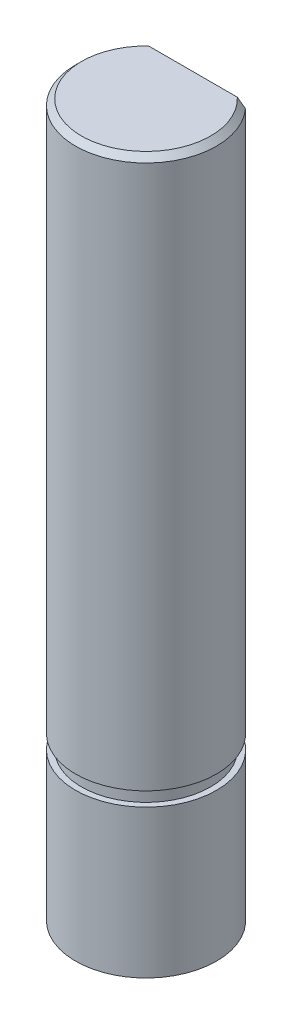
ISO-10303-21;
HEADER;
FILE_DESCRIPTION(('STEP AP214'),'2;1');
FILE_NAME('part.step','',(''),(''),'','','');
FILE_SCHEMA(('AUTOMOTIVE_DESIGN { 1 0 10303 214 1 1 1 1 }'));
ENDSEC;
DATA;
#1=APPLICATION_CONTEXT('core data for automotive mechanical design processes');
#2=APPLICATION_PROTOCOL_DEFINITION('international standard','automotive_design',2000,#1);
#3=PRODUCT_CONTEXT('',#1,'mechanical');
#4=PRODUCT('Part','Part','',(#3));
#5=PRODUCT_RELATED_PRODUCT_CATEGORY('part','',(#4));
#6=PRODUCT_DEFINITION_FORMATION('','',#4);
#7=PRODUCT_DEFINITION_CONTEXT('part definition',#1,'design');
#8=PRODUCT_DEFINITION('design','',#6,#7);
#9=PRODUCT_DEFINITION_SHAPE('','',#8);
#10=(LENGTH_UNIT() NAMED_UNIT(*) SI_UNIT(.MILLI.,.METRE.));
#11=(NAMED_UNIT(*) PLANE_ANGLE_UNIT() SI_UNIT($,.RADIAN.));
#12=(NAMED_UNIT(*) SI_UNIT($,.STERADIAN.) SOLID_ANGLE_UNIT());
#13=UNCERTAINTY_MEASURE_WITH_UNIT(LENGTH_MEASURE(1.E-05),#10,'distance_accuracy_value','');
#14=(GEOMETRIC_REPRESENTATION_CONTEXT(3) GLOBAL_UNCERTAINTY_ASSIGNED_CONTEXT((#13)) GLOBAL_UNIT_ASSIGNED_CONTEXT((#10,
#11,#12)) REPRESENTATION_CONTEXT('',''));
#15=CARTESIAN_POINT('',(0.,0.,0.));
#16=DIRECTION('',(0.,0.,1.));
#17=DIRECTION('',(1.,0.,0.));
#18=AXIS2_PLACEMENT_3D('',#15,#16,#17);
#19=CARTESIAN_POINT('',(0.,16.4,0.));
#20=DIRECTION('',(0.,1.,0.));
#21=DIRECTION('',(-1.,0.,0.));
#22=AXIS2_PLACEMENT_3D('',#19,#20,#21);
#23=CYLINDRICAL_SURFACE('',#22,3.);
#24=DIRECTION('',(0.,1.,0.));
#25=VECTOR('',#24,1.);
#26=CARTESIAN_POINT('',(2.23606797749979,16.4,-2.));
#27=LINE('',#26,#25);
#28=CARTESIAN_POINT('',(2.23606797749979,20.4,-2.));
#29=VERTEX_POINT('',#28);
#30=CARTESIAN_POINT('',(2.23606797749979,40.15,-2.));
#31=VERTEX_POINT('',#30);
#32=EDGE_CURVE('E103',#29,#31,#27,.T.);
#33=ORIENTED_EDGE('',*,*,#32,.T.);
#34=CARTESIAN_POINT('',(0.,40.15,0.));
#35=DIRECTION('',(0.,1.,0.));
#36=DIRECTION('',(-1.,0.,0.));
#37=AXIS2_PLACEMENT_3D('',#34,#35,#36);
#38=CIRCLE('',#37,3.);
#39=CARTESIAN_POINT('',(3.,40.15,0.));
#40=VERTEX_POINT('',#39);
#41=EDGE_CURVE('E26',#40,#31,#38,.T.);
#42=ORIENTED_EDGE('',*,*,#41,.F.);
#43=DIRECTION('',(0.,-1.,0.));
#44=VECTOR('',#43,1.);
#45=CARTESIAN_POINT('',(3.,16.4,0.));
#46=LINE('',#45,#44);
#47=CARTESIAN_POINT('',(3.,17.,0.));
#48=VERTEX_POINT('',#47);
#49=EDGE_CURVE('E11',#40,#48,#46,.T.);
#50=ORIENTED_EDGE('',*,*,#49,.T.);
#51=CARTESIAN_POINT('',(0.,17.,0.));
#52=DIRECTION('',(0.,1.,0.));
#53=DIRECTION('',(-1.,0.,0.));
#54=AXIS2_PLACEMENT_3D('',#51,#52,#53);
#55=CIRCLE('',#54,3.);
#56=EDGE_CURVE('E127',#48,#48,#55,.T.);
#57=ORIENTED_EDGE('',*,*,#56,.T.);
#58=ORIENTED_EDGE('',*,*,#49,.F.);
#59=CARTESIAN_POINT('',(0.,40.15,0.));
#60=DIRECTION('',(0.,1.,0.));
#61=DIRECTION('',(-1.,0.,0.));
#62=AXIS2_PLACEMENT_3D('',#59,#60,#61);
#63=CIRCLE('',#62,3.);
#64=CARTESIAN_POINT('',(-2.23606797749979,40.15,-2.));
#65=VERTEX_POINT('',#64);
#66=EDGE_CURVE('E87',#65,#40,#63,.T.);
#67=ORIENTED_EDGE('',*,*,#66,.F.);
#68=DIRECTION('',(0.,-1.,0.));
#69=VECTOR('',#68,1.);
#70=CARTESIAN_POINT('',(-2.23606797749979,16.4,-2.));
#71=LINE('',#70,#69);
#72=CARTESIAN_POINT('',(-2.23606797749979,20.4,-2.));
#73=VERTEX_POINT('',#72);
#74=EDGE_CURVE('E131',#65,#73,#71,.T.);
#75=ORIENTED_EDGE('',*,*,#74,.T.);
#76=CARTESIAN_POINT('',(0.,20.4,0.));
#77=DIRECTION('',(0.,-1.,0.));
#78=DIRECTION('',(-1.,0.,0.));
#79=AXIS2_PLACEMENT_3D('',#76,#77,#78);
#80=CIRCLE('',#79,3.);
#81=EDGE_CURVE('E88',#73,#29,#80,.T.);
#82=ORIENTED_EDGE('',*,*,#81,.T.);
#83=EDGE_LOOP('',(#33,#42,#50,#57,#58,#67,#75,#82));
#84=FACE_BOUND('',#83,.T.);
#85=ADVANCED_FACE('F16',(#84),#23,.T.);
#86=CARTESIAN_POINT('',(0.,40.275,0.));
#87=DIRECTION('',(0.,-1.,0.));
#88=DIRECTION('',(0.,0.,1.));
#89=AXIS2_PLACEMENT_3D('',#86,#87,#88);
#90=CONICAL_SURFACE('',#89,2.875,0.785398163397442);
#91=CARTESIAN_POINT('',(2.23606797749979,40.15,-2.));
#92=CARTESIAN_POINT('',(2.05418482862217,40.2855676949507,-2.));
#93=CARTESIAN_POINT('',(1.88745860881769,40.4,-2.));
#94=(BOUNDED_CURVE() B_SPLINE_CURVE(2,(#91,#92,#93),.UNSPECIFIED.,.F.,
.F.) B_SPLINE_CURVE_WITH_KNOTS((3,3),(0.,0.0429005754329433),
.UNSPECIFIED.) CURVE() GEOMETRIC_REPRESENTATION_ITEM() RATIONAL_B_SPLINE_CURVE((1.,
1.00184294215737,1.)) REPRESENTATION_ITEM(''));
#95=CARTESIAN_POINT('',(1.88745860881769,40.4,-2.));
#96=VERTEX_POINT('',#95);
#97=EDGE_CURVE('E94',#31,#96,#94,.T.);
#98=ORIENTED_EDGE('',*,*,#97,.T.);
#99=CARTESIAN_POINT('',(0.,40.4,0.));
#100=DIRECTION('',(0.,-1.,0.));
#101=DIRECTION('',(-1.,0.,0.));
#102=AXIS2_PLACEMENT_3D('',#99,#100,#101);
#103=CIRCLE('',#102,2.75);
#104=CARTESIAN_POINT('',(-1.88745860881769,40.4,-2.));
#105=VERTEX_POINT('',#104);
#106=EDGE_CURVE('E50',#96,#105,#103,.T.);
#107=ORIENTED_EDGE('',*,*,#106,.T.);
#108=CARTESIAN_POINT('',(-1.88745860881769,40.4,-2.));
#109=CARTESIAN_POINT('',(-2.05418482862217,40.2855676949507,-2.));
#110=CARTESIAN_POINT('',(-2.23606797749979,40.15,-2.));
#111=(BOUNDED_CURVE() B_SPLINE_CURVE(2,(#108,#109,#110),.UNSPECIFIED.,.F.,
.F.) B_SPLINE_CURVE_WITH_KNOTS((3,3),(0.,0.0429005754329433),
.UNSPECIFIED.) CURVE() GEOMETRIC_REPRESENTATION_ITEM() RATIONAL_B_SPLINE_CURVE((1.,
1.00184294215737,1.)) REPRESENTATION_ITEM(''));
#112=EDGE_CURVE('E96',#105,#65,#111,.T.);
#113=ORIENTED_EDGE('',*,*,#112,.T.);
#114=ORIENTED_EDGE('',*,*,#66,.T.);
#115=ORIENTED_EDGE('',*,*,#41,.T.);
#116=EDGE_LOOP('',(#98,#107,#113,#114,#115));
#117=FACE_BOUND('',#116,.T.);
#118=ADVANCED_FACE('F99',(#117),#90,.T.);
#119=CARTESIAN_POINT('',(0.,40.4,0.));
#120=DIRECTION('',(0.,1.,0.));
#121=DIRECTION('',(1.,0.,0.));
#122=AXIS2_PLACEMENT_3D('',#119,#120,#121);
#123=PLANE('',#122);
#124=DIRECTION('',(-1.,0.,0.));
#125=VECTOR('',#124,1.);
#126=CARTESIAN_POINT('',(1.11803398874989,40.4,-2.));
#127=LINE('',#126,#125);
#128=EDGE_CURVE('E84',#96,#105,#127,.T.);
#129=ORIENTED_EDGE('',*,*,#128,.T.);
#130=ORIENTED_EDGE('',*,*,#106,.F.);
#131=EDGE_LOOP('',(#129,#130));
#132=FACE_BOUND('',#131,.T.);
#133=ADVANCED_FACE('F83',(#132),#123,.T.);
#134=CARTESIAN_POINT('',(0.,20.4,-2.5));
#135=DIRECTION('',(0.,1.,0.));
#136=DIRECTION('',(1.,0.,0.));
#137=AXIS2_PLACEMENT_3D('',#134,#135,#136);
#138=PLANE('',#137);
#139=ORIENTED_EDGE('',*,*,#81,.F.);
#140=DIRECTION('',(-1.,0.,0.));
#141=VECTOR('',#140,1.);
#142=CARTESIAN_POINT('',(1.11803398874989,20.4,-2.));
#143=LINE('',#142,#141);
#144=EDGE_CURVE('E111',#29,#73,#143,.T.);
#145=ORIENTED_EDGE('',*,*,#144,.F.);
#146=EDGE_LOOP('',(#139,#145));
#147=FACE_BOUND('',#146,.T.);
#148=ADVANCED_FACE('F152',(#147),#138,.T.);
#149=CARTESIAN_POINT('',(2.23606797749979,40.4,-2.));
#150=DIRECTION('',(0.,0.,1.));
#151=DIRECTION('',(1.,0.,0.));
#152=AXIS2_PLACEMENT_3D('',#149,#150,#151);
#153=PLANE('',#152);
#154=ORIENTED_EDGE('',*,*,#97,.F.);
#155=ORIENTED_EDGE('',*,*,#32,.F.);
#156=ORIENTED_EDGE('',*,*,#144,.T.);
#157=ORIENTED_EDGE('',*,*,#74,.F.);
#158=ORIENTED_EDGE('',*,*,#112,.F.);
#159=ORIENTED_EDGE('',*,*,#128,.F.);
#160=EDGE_LOOP('',(#154,#155,#156,#157,#158,#159));
#161=FACE_BOUND('',#160,.T.);
#162=ADVANCED_FACE('F92',(#161),#153,.F.);
#163=CARTESIAN_POINT('',(0.,10.1,0.));
#164=DIRECTION('',(0.,1.,0.));
#165=DIRECTION('',(1.,0.,0.));
#166=AXIS2_PLACEMENT_3D('',#163,#164,#165);
#167=PLANE('',#166);
#168=CARTESIAN_POINT('',(0.,10.1,0.));
#169=DIRECTION('',(0.,-1.,0.));
#170=DIRECTION('',(-1.,0.,0.));
#171=AXIS2_PLACEMENT_3D('',#168,#169,#170);
#172=CIRCLE('',#171,3.);
#173=CARTESIAN_POINT('',(3.,10.1,0.));
#174=VERTEX_POINT('',#173);
#175=EDGE_CURVE('E104',#174,#174,#172,.T.);
#176=ORIENTED_EDGE('',*,*,#175,.T.);
#177=EDGE_LOOP('',(#176));
#178=FACE_BOUND('',#177,.T.);
#179=ADVANCED_FACE('F235',(#178),#167,.F.);
#180=CARTESIAN_POINT('',(0.,16.4,0.));
#181=DIRECTION('',(0.,1.,0.));
#182=DIRECTION('',(-1.,0.,0.));
#183=AXIS2_PLACEMENT_3D('',#180,#181,#182);
#184=CYLINDRICAL_SURFACE('',#183,3.);
#185=CARTESIAN_POINT('',(0.,16.4,0.));
#186=DIRECTION('',(0.,-1.,0.));
#187=DIRECTION('',(-1.,0.,0.));
#188=AXIS2_PLACEMENT_3D('',#185,#186,#187);
#189=CIRCLE('',#188,3.);
#190=CARTESIAN_POINT('',(3.,16.4,0.));
#191=VERTEX_POINT('',#190);
#192=EDGE_CURVE('E123',#191,#191,#189,.T.);
#193=ORIENTED_EDGE('',*,*,#192,.T.);
#194=DIRECTION('',(0.,-1.,0.));
#195=VECTOR('',#194,1.);
#196=CARTESIAN_POINT('',(3.,16.4,0.));
#197=LINE('',#196,#195);
#198=EDGE_CURVE('E113',#191,#174,#197,.T.);
#199=ORIENTED_EDGE('',*,*,#198,.T.);
#200=ORIENTED_EDGE('',*,*,#175,.F.);
#201=ORIENTED_EDGE('',*,*,#198,.F.);
#202=EDGE_LOOP('',(#193,#199,#200,#201));
#203=FACE_BOUND('',#202,.T.);
#204=ADVANCED_FACE('F229',(#203),#184,.T.);
#205=CARTESIAN_POINT('',(0.,16.4,0.));
#206=DIRECTION('',(0.,1.,0.));
#207=DIRECTION('',(1.,0.,0.));
#208=AXIS2_PLACEMENT_3D('',#205,#206,#207);
#209=PLANE('',#208);
#210=CARTESIAN_POINT('',(0.,16.4,0.));
#211=DIRECTION('',(0.,1.,0.));
#212=DIRECTION('',(-1.,0.,0.));
#213=AXIS2_PLACEMENT_3D('',#210,#211,#212);
#214=CIRCLE('',#213,2.75);
#215=CARTESIAN_POINT('',(2.75,16.4,0.));
#216=VERTEX_POINT('',#215);
#217=EDGE_CURVE('E142',#216,#216,#214,.T.);
#218=ORIENTED_EDGE('',*,*,#217,.F.);
#219=EDGE_LOOP('',(#218));
#220=FACE_BOUND('',#219,.T.);
#221=ORIENTED_EDGE('',*,*,#192,.F.);
#222=EDGE_LOOP('',(#221));
#223=FACE_BOUND('',#222,.T.);
#224=ADVANCED_FACE('F174',(#220,#223),#209,.T.);
#225=CARTESIAN_POINT('',(0.,17.,0.));
#226=DIRECTION('',(0.,1.,0.));
#227=DIRECTION('',(1.,0.,0.));
#228=AXIS2_PLACEMENT_3D('',#225,#226,#227);
#229=PLANE('',#228);
#230=CARTESIAN_POINT('',(0.,17.,0.));
#231=DIRECTION('',(0.,-1.,0.));
#232=DIRECTION('',(-1.,0.,0.));
#233=AXIS2_PLACEMENT_3D('',#230,#231,#232);
#234=CIRCLE('',#233,2.75);
#235=CARTESIAN_POINT('',(2.75,17.,0.));
#236=VERTEX_POINT('',#235);
#237=EDGE_CURVE('E20',#236,#236,#234,.T.);
#238=ORIENTED_EDGE('',*,*,#237,.F.);
#239=EDGE_LOOP('',(#238));
#240=FACE_BOUND('',#239,.T.);
#241=ORIENTED_EDGE('',*,*,#56,.F.);
#242=EDGE_LOOP('',(#241));
#243=FACE_BOUND('',#242,.T.);
#244=ADVANCED_FACE('F171',(#240,#243),#229,.F.);
#245=CARTESIAN_POINT('',(0.,16.4,0.));
#246=DIRECTION('',(0.,1.,0.));
#247=DIRECTION('',(-1.,0.,0.));
#248=AXIS2_PLACEMENT_3D('',#245,#246,#247);
#249=CYLINDRICAL_SURFACE('',#248,2.75);
#250=ORIENTED_EDGE('',*,*,#217,.T.);
#251=DIRECTION('',(0.,1.,0.));
#252=VECTOR('',#251,1.);
#253=CARTESIAN_POINT('',(2.75,16.4,0.));
#254=LINE('',#253,#252);
#255=EDGE_CURVE('E145',#216,#236,#254,.T.);
#256=ORIENTED_EDGE('',*,*,#255,.T.);
#257=ORIENTED_EDGE('',*,*,#237,.T.);
#258=ORIENTED_EDGE('',*,*,#255,.F.);
#259=EDGE_LOOP('',(#250,#256,#257,#258));
#260=FACE_BOUND('',#259,.T.);
#261=ADVANCED_FACE('F18',(#260),#249,.T.);
#262=CLOSED_SHELL('',(#85,#118,#133,#148,#162,#179,#204,#224,#244,#261));
#263=MANIFOLD_SOLID_BREP('B1',#262);
#264=ADVANCED_BREP_SHAPE_REPRESENTATION('',(#18,#263),#14);
#265=SHAPE_DEFINITION_REPRESENTATION(#9,#264);
ENDSEC;
END-ISO-10303-21;
